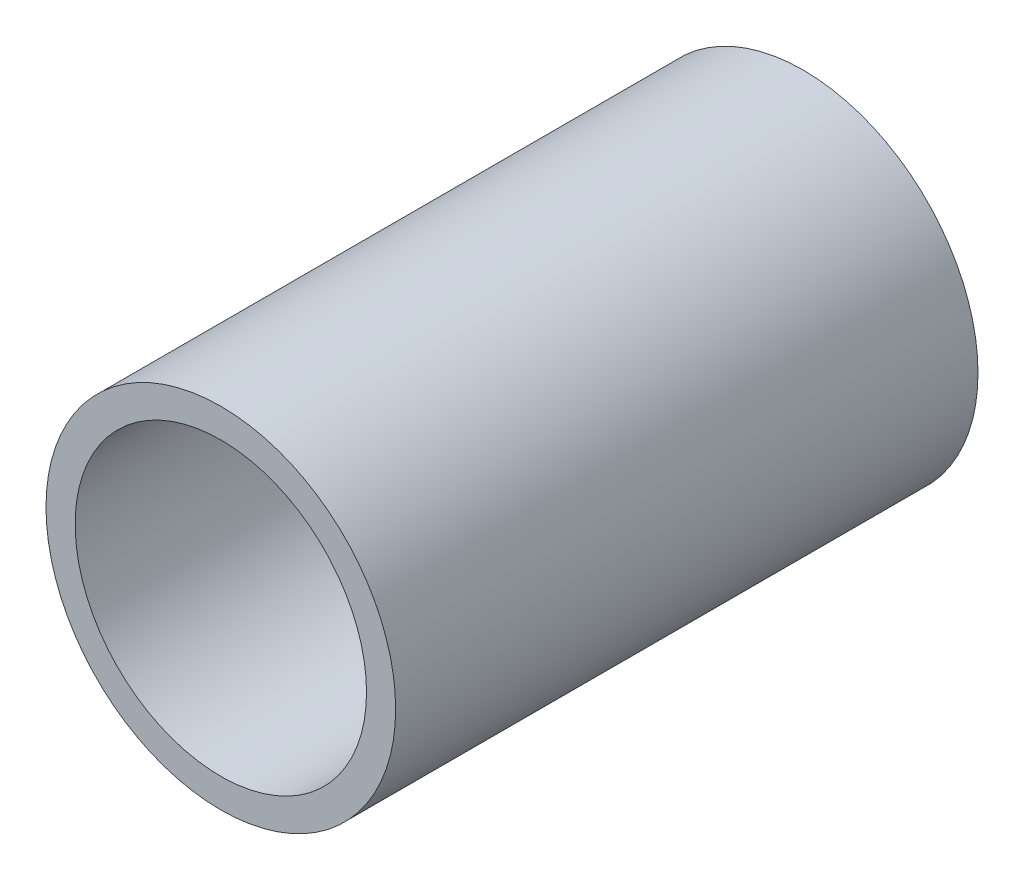
ISO-10303-21;
HEADER;
FILE_DESCRIPTION(('STEP AP214'),'2;1');
FILE_NAME('part.step','',(''),(''),'','','');
FILE_SCHEMA(('AUTOMOTIVE_DESIGN { 1 0 10303 214 1 1 1 1 }'));
ENDSEC;
DATA;
#1=APPLICATION_CONTEXT('core data for automotive mechanical design processes');
#2=APPLICATION_PROTOCOL_DEFINITION('international standard','automotive_design',2000,#1);
#3=PRODUCT_CONTEXT('',#1,'mechanical');
#4=PRODUCT('Part','Part','',(#3));
#5=PRODUCT_RELATED_PRODUCT_CATEGORY('part','',(#4));
#6=PRODUCT_DEFINITION_FORMATION('','',#4);
#7=PRODUCT_DEFINITION_CONTEXT('part definition',#1,'design');
#8=PRODUCT_DEFINITION('design','',#6,#7);
#9=PRODUCT_DEFINITION_SHAPE('','',#8);
#10=(LENGTH_UNIT() NAMED_UNIT(*) SI_UNIT(.MILLI.,.METRE.));
#11=(NAMED_UNIT(*) PLANE_ANGLE_UNIT() SI_UNIT($,.RADIAN.));
#12=(NAMED_UNIT(*) SI_UNIT($,.STERADIAN.) SOLID_ANGLE_UNIT());
#13=UNCERTAINTY_MEASURE_WITH_UNIT(LENGTH_MEASURE(1.E-05),#10,'distance_accuracy_value','');
#14=(GEOMETRIC_REPRESENTATION_CONTEXT(3) GLOBAL_UNCERTAINTY_ASSIGNED_CONTEXT((#13)) GLOBAL_UNIT_ASSIGNED_CONTEXT((#10,
#11,#12)) REPRESENTATION_CONTEXT('',''));
#15=CARTESIAN_POINT('',(0.,0.,0.));
#16=DIRECTION('',(0.,0.,1.));
#17=DIRECTION('',(1.,0.,0.));
#18=AXIS2_PLACEMENT_3D('',#15,#16,#17);
#19=CARTESIAN_POINT('',(0.,0.,31.75));
#20=DIRECTION('',(0.,0.,1.));
#21=DIRECTION('',(1.,0.,0.));
#22=AXIS2_PLACEMENT_3D('',#19,#20,#21);
#23=PLANE('',#22);
#24=CARTESIAN_POINT('',(0.,0.,31.75));
#25=DIRECTION('',(0.,0.,1.));
#26=DIRECTION('',(1.,0.,0.));
#27=AXIS2_PLACEMENT_3D('',#24,#25,#26);
#28=CIRCLE('',#27,19.0627);
#29=CARTESIAN_POINT('',(19.0627,0.,31.75));
#30=VERTEX_POINT('',#29);
#31=EDGE_CURVE('E10',#30,#30,#28,.T.);
#32=ORIENTED_EDGE('',*,*,#31,.T.);
#33=EDGE_LOOP('',(#32));
#34=FACE_BOUND('',#33,.T.);
#35=CARTESIAN_POINT('',(0.,0.,31.75));
#36=DIRECTION('',(0.,0.,1.));
#37=DIRECTION('',(1.,0.,0.));
#38=AXIS2_PLACEMENT_3D('',#35,#36,#37);
#39=CIRCLE('',#38,15.8877);
#40=CARTESIAN_POINT('',(15.8877,0.,31.75));
#41=VERTEX_POINT('',#40);
#42=EDGE_CURVE('E42',#41,#41,#39,.T.);
#43=ORIENTED_EDGE('',*,*,#42,.F.);
#44=EDGE_LOOP('',(#43));
#45=FACE_BOUND('',#44,.T.);
#46=ADVANCED_FACE('F31',(#34,#45),#23,.T.);
#47=CARTESIAN_POINT('',(0.,0.,-31.75));
#48=DIRECTION('',(0.,0.,1.));
#49=DIRECTION('',(1.,0.,0.));
#50=AXIS2_PLACEMENT_3D('',#47,#48,#49);
#51=PLANE('',#50);
#52=CARTESIAN_POINT('',(0.,0.,-31.75));
#53=DIRECTION('',(0.,0.,1.));
#54=DIRECTION('',(1.,0.,0.));
#55=AXIS2_PLACEMENT_3D('',#52,#53,#54);
#56=CIRCLE('',#55,19.0627);
#57=CARTESIAN_POINT('',(19.0627,0.,-31.75));
#58=VERTEX_POINT('',#57);
#59=EDGE_CURVE('E35',#58,#58,#56,.T.);
#60=ORIENTED_EDGE('',*,*,#59,.F.);
#61=EDGE_LOOP('',(#60));
#62=FACE_BOUND('',#61,.T.);
#63=CARTESIAN_POINT('',(0.,0.,-31.75));
#64=DIRECTION('',(0.,0.,1.));
#65=DIRECTION('',(1.,0.,0.));
#66=AXIS2_PLACEMENT_3D('',#63,#64,#65);
#67=CIRCLE('',#66,15.8877);
#68=CARTESIAN_POINT('',(15.8877,0.,-31.75));
#69=VERTEX_POINT('',#68);
#70=EDGE_CURVE('E44',#69,#69,#67,.T.);
#71=ORIENTED_EDGE('',*,*,#70,.T.);
#72=EDGE_LOOP('',(#71));
#73=FACE_BOUND('',#72,.T.);
#74=ADVANCED_FACE('F54',(#62,#73),#51,.F.);
#75=CARTESIAN_POINT('',(0.,0.,31.75));
#76=DIRECTION('',(0.,0.,-1.));
#77=DIRECTION('',(-1.,0.,0.));
#78=AXIS2_PLACEMENT_3D('',#75,#76,#77);
#79=CYLINDRICAL_SURFACE('',#78,19.0627);
#80=ORIENTED_EDGE('',*,*,#31,.F.);
#81=EDGE_LOOP('',(#80));
#82=FACE_BOUND('',#81,.T.);
#83=ORIENTED_EDGE('',*,*,#59,.T.);
#84=EDGE_LOOP('',(#83));
#85=FACE_BOUND('',#84,.T.);
#86=ADVANCED_FACE('F33',(#82,#85),#79,.T.);
#87=CARTESIAN_POINT('',(0.,0.,31.75));
#88=DIRECTION('',(0.,0.,-1.));
#89=DIRECTION('',(-1.,0.,0.));
#90=AXIS2_PLACEMENT_3D('',#87,#88,#89);
#91=CYLINDRICAL_SURFACE('',#90,15.8877);
#92=ORIENTED_EDGE('',*,*,#42,.T.);
#93=EDGE_LOOP('',(#92));
#94=FACE_BOUND('',#93,.T.);
#95=ORIENTED_EDGE('',*,*,#70,.F.);
#96=EDGE_LOOP('',(#95));
#97=FACE_BOUND('',#96,.T.);
#98=ADVANCED_FACE('F50',(#94,#97),#91,.F.);
#99=CLOSED_SHELL('',(#46,#74,#86,#98));
#100=MANIFOLD_SOLID_BREP('B2',#99);
#101=ADVANCED_BREP_SHAPE_REPRESENTATION('',(#18,#100),#14);
#102=SHAPE_DEFINITION_REPRESENTATION(#9,#101);
ENDSEC;
END-ISO-10303-21;
